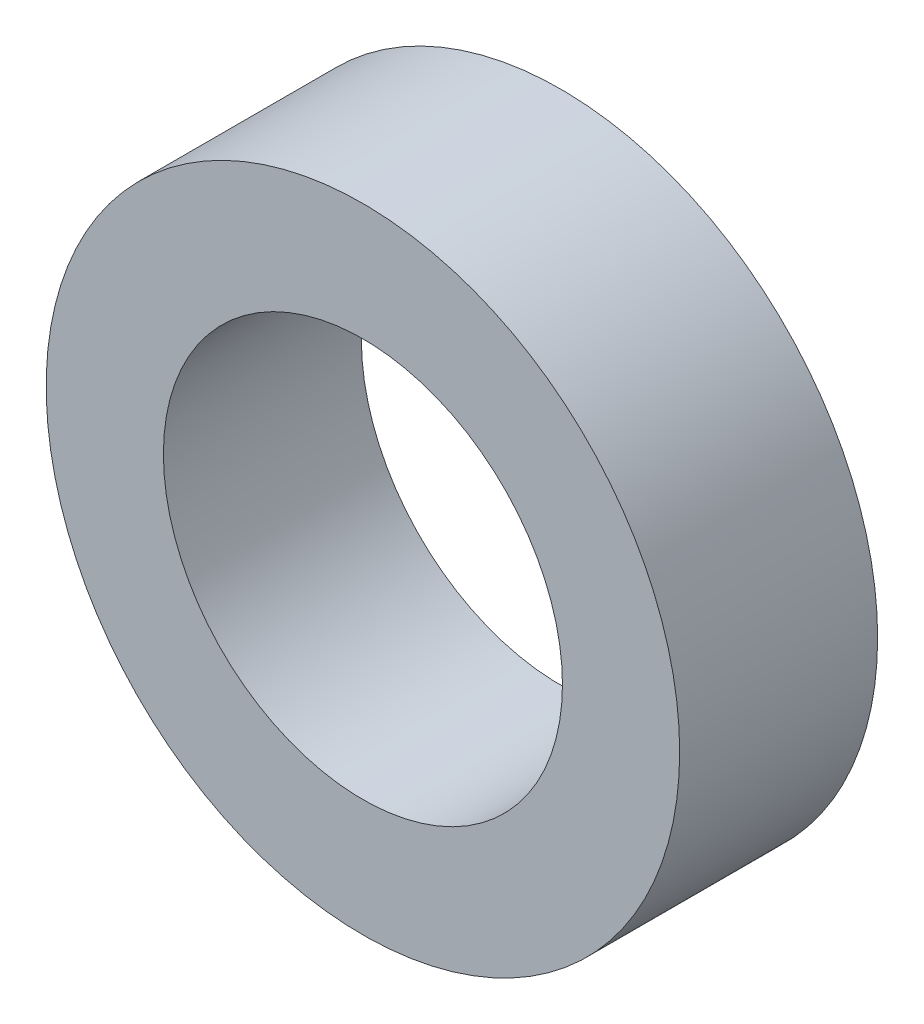
ISO-10303-21;
HEADER;
FILE_DESCRIPTION(('STEP AP214'),'2;1');
FILE_NAME('part.step','',(''),(''),'','','');
FILE_SCHEMA(('AUTOMOTIVE_DESIGN { 1 0 10303 214 1 1 1 1 }'));
ENDSEC;
DATA;
#1=APPLICATION_CONTEXT('core data for automotive mechanical design processes');
#2=APPLICATION_PROTOCOL_DEFINITION('international standard','automotive_design',2000,#1);
#3=PRODUCT_CONTEXT('',#1,'mechanical');
#4=PRODUCT('Part','Part','',(#3));
#5=PRODUCT_RELATED_PRODUCT_CATEGORY('part','',(#4));
#6=PRODUCT_DEFINITION_FORMATION('','',#4);
#7=PRODUCT_DEFINITION_CONTEXT('part definition',#1,'design');
#8=PRODUCT_DEFINITION('design','',#6,#7);
#9=PRODUCT_DEFINITION_SHAPE('','',#8);
#10=(LENGTH_UNIT() NAMED_UNIT(*) SI_UNIT(.MILLI.,.METRE.));
#11=(NAMED_UNIT(*) PLANE_ANGLE_UNIT() SI_UNIT($,.RADIAN.));
#12=(NAMED_UNIT(*) SI_UNIT($,.STERADIAN.) SOLID_ANGLE_UNIT());
#13=UNCERTAINTY_MEASURE_WITH_UNIT(LENGTH_MEASURE(1.E-05),#10,'distance_accuracy_value','');
#14=(GEOMETRIC_REPRESENTATION_CONTEXT(3) GLOBAL_UNCERTAINTY_ASSIGNED_CONTEXT((#13)) GLOBAL_UNIT_ASSIGNED_CONTEXT((#10,
#11,#12)) REPRESENTATION_CONTEXT('',''));
#15=CARTESIAN_POINT('',(0.,0.,0.));
#16=DIRECTION('',(0.,0.,1.));
#17=DIRECTION('',(1.,0.,0.));
#18=AXIS2_PLACEMENT_3D('',#15,#16,#17);
#19=CARTESIAN_POINT('',(0.,0.,3.96875));
#20=DIRECTION('',(0.,0.,1.));
#21=DIRECTION('',(1.,0.,0.));
#22=AXIS2_PLACEMENT_3D('',#19,#20,#21);
#23=PLANE('',#22);
#24=CARTESIAN_POINT('',(0.,0.,3.96875));
#25=DIRECTION('',(0.,0.,1.));
#26=DIRECTION('',(1.,0.,0.));
#27=AXIS2_PLACEMENT_3D('',#24,#25,#26);
#28=CIRCLE('',#27,6.35);
#29=CARTESIAN_POINT('',(6.35,0.,3.96875));
#30=VERTEX_POINT('',#29);
#31=EDGE_CURVE('E10',#30,#30,#28,.T.);
#32=ORIENTED_EDGE('',*,*,#31,.T.);
#33=EDGE_LOOP('',(#32));
#34=FACE_BOUND('',#33,.T.);
#35=CARTESIAN_POINT('',(0.,0.,3.96875));
#36=DIRECTION('',(0.,0.,1.));
#37=DIRECTION('',(1.,0.,0.));
#38=AXIS2_PLACEMENT_3D('',#35,#36,#37);
#39=CIRCLE('',#38,4.);
#40=CARTESIAN_POINT('',(4.,0.,3.96875));
#41=VERTEX_POINT('',#40);
#42=EDGE_CURVE('E42',#41,#41,#39,.T.);
#43=ORIENTED_EDGE('',*,*,#42,.F.);
#44=EDGE_LOOP('',(#43));
#45=FACE_BOUND('',#44,.T.);
#46=ADVANCED_FACE('F31',(#34,#45),#23,.T.);
#47=CARTESIAN_POINT('',(0.,0.,0.));
#48=DIRECTION('',(0.,0.,1.));
#49=DIRECTION('',(1.,0.,0.));
#50=AXIS2_PLACEMENT_3D('',#47,#48,#49);
#51=PLANE('',#50);
#52=CARTESIAN_POINT('',(0.,0.,0.));
#53=DIRECTION('',(0.,0.,1.));
#54=DIRECTION('',(1.,0.,0.));
#55=AXIS2_PLACEMENT_3D('',#52,#53,#54);
#56=CIRCLE('',#55,6.35);
#57=CARTESIAN_POINT('',(6.35,0.,0.));
#58=VERTEX_POINT('',#57);
#59=EDGE_CURVE('E35',#58,#58,#56,.T.);
#60=ORIENTED_EDGE('',*,*,#59,.F.);
#61=EDGE_LOOP('',(#60));
#62=FACE_BOUND('',#61,.T.);
#63=CARTESIAN_POINT('',(0.,0.,0.));
#64=DIRECTION('',(0.,0.,1.));
#65=DIRECTION('',(1.,0.,0.));
#66=AXIS2_PLACEMENT_3D('',#63,#64,#65);
#67=CIRCLE('',#66,4.);
#68=CARTESIAN_POINT('',(4.,0.,0.));
#69=VERTEX_POINT('',#68);
#70=EDGE_CURVE('E44',#69,#69,#67,.T.);
#71=ORIENTED_EDGE('',*,*,#70,.T.);
#72=EDGE_LOOP('',(#71));
#73=FACE_BOUND('',#72,.T.);
#74=ADVANCED_FACE('F54',(#62,#73),#51,.F.);
#75=CARTESIAN_POINT('',(0.,0.,3.96875));
#76=DIRECTION('',(0.,0.,-1.));
#77=DIRECTION('',(-1.,0.,0.));
#78=AXIS2_PLACEMENT_3D('',#75,#76,#77);
#79=CYLINDRICAL_SURFACE('',#78,6.35);
#80=ORIENTED_EDGE('',*,*,#31,.F.);
#81=EDGE_LOOP('',(#80));
#82=FACE_BOUND('',#81,.T.);
#83=ORIENTED_EDGE('',*,*,#59,.T.);
#84=EDGE_LOOP('',(#83));
#85=FACE_BOUND('',#84,.T.);
#86=ADVANCED_FACE('F33',(#82,#85),#79,.T.);
#87=CARTESIAN_POINT('',(0.,0.,3.96875));
#88=DIRECTION('',(0.,0.,-1.));
#89=DIRECTION('',(-1.,0.,0.));
#90=AXIS2_PLACEMENT_3D('',#87,#88,#89);
#91=CYLINDRICAL_SURFACE('',#90,4.);
#92=ORIENTED_EDGE('',*,*,#42,.T.);
#93=EDGE_LOOP('',(#92));
#94=FACE_BOUND('',#93,.T.);
#95=ORIENTED_EDGE('',*,*,#70,.F.);
#96=EDGE_LOOP('',(#95));
#97=FACE_BOUND('',#96,.T.);
#98=ADVANCED_FACE('F50',(#94,#97),#91,.F.);
#99=CLOSED_SHELL('',(#46,#74,#86,#98));
#100=MANIFOLD_SOLID_BREP('B2',#99);
#101=ADVANCED_BREP_SHAPE_REPRESENTATION('',(#18,#100),#14);
#102=SHAPE_DEFINITION_REPRESENTATION(#9,#101);
ENDSEC;
END-ISO-10303-21;
